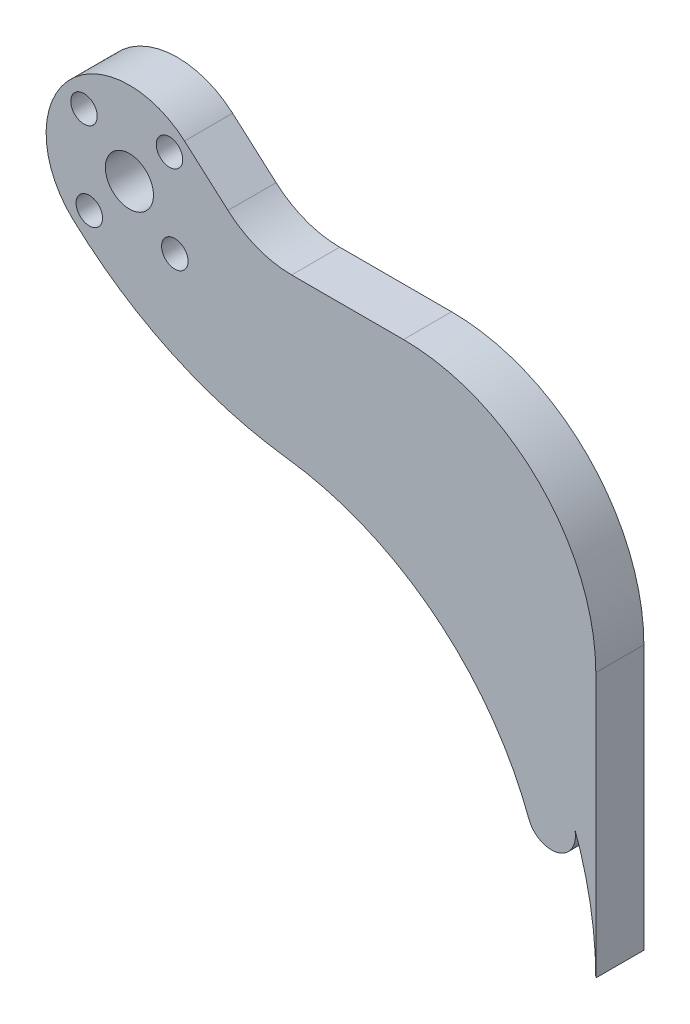
ISO-10303-21;
HEADER;
FILE_DESCRIPTION(('STEP AP214'),'2;1');
FILE_NAME('part.step','',(''),(''),'','','');
FILE_SCHEMA(('AUTOMOTIVE_DESIGN { 1 0 10303 214 1 1 1 1 }'));
ENDSEC;
DATA;
#1=APPLICATION_CONTEXT('core data for automotive mechanical design processes');
#2=APPLICATION_PROTOCOL_DEFINITION('international standard','automotive_design',2000,#1);
#3=PRODUCT_CONTEXT('',#1,'mechanical');
#4=PRODUCT('Part','Part','',(#3));
#5=PRODUCT_RELATED_PRODUCT_CATEGORY('part','',(#4));
#6=PRODUCT_DEFINITION_FORMATION('','',#4);
#7=PRODUCT_DEFINITION_CONTEXT('part definition',#1,'design');
#8=PRODUCT_DEFINITION('design','',#6,#7);
#9=PRODUCT_DEFINITION_SHAPE('','',#8);
#10=(LENGTH_UNIT() NAMED_UNIT(*) SI_UNIT(.MILLI.,.METRE.));
#11=(NAMED_UNIT(*) PLANE_ANGLE_UNIT() SI_UNIT($,.RADIAN.));
#12=(NAMED_UNIT(*) SI_UNIT($,.STERADIAN.) SOLID_ANGLE_UNIT());
#13=UNCERTAINTY_MEASURE_WITH_UNIT(LENGTH_MEASURE(1.E-05),#10,'distance_accuracy_value','');
#14=(GEOMETRIC_REPRESENTATION_CONTEXT(3) GLOBAL_UNCERTAINTY_ASSIGNED_CONTEXT((#13)) GLOBAL_UNIT_ASSIGNED_CONTEXT((#10,
#11,#12)) REPRESENTATION_CONTEXT('',''));
#15=CARTESIAN_POINT('',(0.,0.,0.));
#16=DIRECTION('',(0.,0.,1.));
#17=DIRECTION('',(1.,0.,0.));
#18=AXIS2_PLACEMENT_3D('',#15,#16,#17);
#19=CARTESIAN_POINT('',(11.2309982796719,89.467835436217,6.35));
#20=DIRECTION('',(0.,0.,-1.));
#21=DIRECTION('',(-1.,0.,0.));
#22=AXIS2_PLACEMENT_3D('',#19,#20,#21);
#23=CYLINDRICAL_SURFACE('',#22,50.8);
#24=CARTESIAN_POINT('',(11.2309982796719,89.467835436217,0.));
#25=DIRECTION('',(0.,0.,1.));
#26=DIRECTION('',(1.,0.,0.));
#27=AXIS2_PLACEMENT_3D('',#24,#25,#26);
#28=CIRCLE('',#27,50.8);
#29=CARTESIAN_POINT('',(-23.3666075647334,52.2704474925029,0.));
#30=VERTEX_POINT('',#29);
#31=CARTESIAN_POINT('',(4.90367530520886,39.0634211059539,0.));
#32=VERTEX_POINT('',#31);
#33=EDGE_CURVE('E165',#30,#32,#28,.T.);
#34=ORIENTED_EDGE('',*,*,#33,.T.);
#35=DIRECTION('',(0.,0.,-1.));
#36=VECTOR('',#35,1.);
#37=CARTESIAN_POINT('',(4.90367530520886,39.0634211059539,6.35));
#38=LINE('',#37,#36);
#39=CARTESIAN_POINT('',(4.90367530520886,39.0634211059539,6.35));
#40=VERTEX_POINT('',#39);
#41=EDGE_CURVE('E199',#40,#32,#38,.T.);
#42=ORIENTED_EDGE('',*,*,#41,.F.);
#43=CARTESIAN_POINT('',(11.2309982796719,89.467835436217,6.35));
#44=DIRECTION('',(0.,0.,1.));
#45=DIRECTION('',(1.,0.,0.));
#46=AXIS2_PLACEMENT_3D('',#43,#44,#45);
#47=CIRCLE('',#46,50.8);
#48=CARTESIAN_POINT('',(-23.3666075647334,52.2704474925029,6.35));
#49=VERTEX_POINT('',#48);
#50=EDGE_CURVE('E168',#49,#40,#47,.T.);
#51=ORIENTED_EDGE('',*,*,#50,.F.);
#52=DIRECTION('',(0.,0.,-1.));
#53=VECTOR('',#52,1.);
#54=CARTESIAN_POINT('',(-23.3666075647334,52.2704474925029,6.35));
#55=LINE('',#54,#53);
#56=EDGE_CURVE('E179',#49,#30,#55,.T.);
#57=ORIENTED_EDGE('',*,*,#56,.T.);
#58=EDGE_LOOP('',(#34,#42,#51,#57));
#59=FACE_BOUND('',#58,.T.);
#60=ADVANCED_FACE('F33',(#59),#23,.T.);
#61=CARTESIAN_POINT('',(0.,0.,6.35));
#62=DIRECTION('',(0.,0.,-1.));
#63=DIRECTION('',(-1.,0.,0.));
#64=AXIS2_PLACEMENT_3D('',#61,#62,#63);
#65=CYLINDRICAL_SURFACE('',#64,39.37);
#66=CARTESIAN_POINT('',(0.,0.,0.));
#67=DIRECTION('',(0.,0.,-1.));
#68=DIRECTION('',(1.,0.,0.));
#69=AXIS2_PLACEMENT_3D('',#66,#67,#68);
#70=CIRCLE('',#69,39.37);
#71=CARTESIAN_POINT('',(36.8802784944892,13.778314779715,0.));
#72=VERTEX_POINT('',#71);
#73=EDGE_CURVE('E182',#32,#72,#70,.T.);
#74=ORIENTED_EDGE('',*,*,#73,.T.);
#75=DIRECTION('',(0.,0.,-1.));
#76=VECTOR('',#75,1.);
#77=CARTESIAN_POINT('',(36.8802784944892,13.778314779715,6.35));
#78=LINE('',#77,#76);
#79=CARTESIAN_POINT('',(36.8802784944892,13.778314779715,6.35));
#80=VERTEX_POINT('',#79);
#81=EDGE_CURVE('E196',#80,#72,#78,.T.);
#82=ORIENTED_EDGE('',*,*,#81,.F.);
#83=CARTESIAN_POINT('',(0.,0.,6.35));
#84=DIRECTION('',(0.,0.,-1.));
#85=DIRECTION('',(1.,0.,0.));
#86=AXIS2_PLACEMENT_3D('',#83,#84,#85);
#87=CIRCLE('',#86,39.37);
#88=EDGE_CURVE('E171',#40,#80,#87,.T.);
#89=ORIENTED_EDGE('',*,*,#88,.F.);
#90=ORIENTED_EDGE('',*,*,#41,.T.);
#91=EDGE_LOOP('',(#74,#82,#89,#90));
#92=FACE_BOUND('',#91,.T.);
#93=ADVANCED_FACE('F241',(#92),#65,.F.);
#94=CARTESIAN_POINT('',(39.8544945021093,14.889469197434,6.35));
#95=DIRECTION('',(0.,0.,-1.));
#96=DIRECTION('',(-1.,0.,0.));
#97=AXIS2_PLACEMENT_3D('',#94,#95,#96);
#98=CYLINDRICAL_SURFACE('',#97,3.175);
#99=CARTESIAN_POINT('',(39.8544945021093,14.889469197434,0.));
#100=DIRECTION('',(0.,0.,1.));
#101=DIRECTION('',(1.,0.,0.));
#102=AXIS2_PLACEMENT_3D('',#99,#100,#101);
#103=CIRCLE('',#102,3.175);
#104=CARTESIAN_POINT('',(42.8287105097295,16.0006236151529,0.));
#105=VERTEX_POINT('',#104);
#106=EDGE_CURVE('E184',#72,#105,#103,.T.);
#107=ORIENTED_EDGE('',*,*,#106,.T.);
#108=DIRECTION('',(0.,0.,-1.));
#109=VECTOR('',#108,1.);
#110=CARTESIAN_POINT('',(42.8287105097295,16.0006236151529,6.35));
#111=LINE('',#110,#109);
#112=CARTESIAN_POINT('',(42.8287105097295,16.0006236151529,6.35));
#113=VERTEX_POINT('',#112);
#114=EDGE_CURVE('E194',#113,#105,#111,.T.);
#115=ORIENTED_EDGE('',*,*,#114,.F.);
#116=CARTESIAN_POINT('',(39.8544945021093,14.889469197434,6.35));
#117=DIRECTION('',(0.,0.,1.));
#118=DIRECTION('',(1.,0.,0.));
#119=AXIS2_PLACEMENT_3D('',#116,#117,#118);
#120=CIRCLE('',#119,3.175);
#121=EDGE_CURVE('E128',#80,#113,#120,.T.);
#122=ORIENTED_EDGE('',*,*,#121,.F.);
#123=ORIENTED_EDGE('',*,*,#81,.T.);
#124=EDGE_LOOP('',(#107,#115,#122,#123));
#125=FACE_BOUND('',#124,.T.);
#126=ADVANCED_FACE('F247',(#125),#98,.T.);
#127=CARTESIAN_POINT('',(-8.59545500908298,68.5717099333744,6.35));
#128=DIRECTION('',(-0.661776817356092,-0.749700903034031,0.));
#129=DIRECTION('',(0.749700903034031,-0.661776817356092,0.));
#130=AXIS2_PLACEMENT_3D('',#127,#128,#129);
#131=PLANE('',#130);
#132=DIRECTION('',(-0.749700903034031,0.661776817356092,0.));
#133=VECTOR('',#132,1.);
#134=CARTESIAN_POINT('',(-8.59545500908298,68.5717099333744,6.35));
#135=LINE('',#134,#133);
#136=CARTESIAN_POINT('',(-2.8542176993732,63.5037985314678,6.35));
#137=VERTEX_POINT('',#136);
#138=CARTESIAN_POINT('',(-8.59545500908298,68.5717099333744,6.35));
#139=VERTEX_POINT('',#138);
#140=EDGE_CURVE('E175',#137,#139,#135,.T.);
#141=ORIENTED_EDGE('',*,*,#140,.F.);
#142=DIRECTION('',(0.,0.,-1.));
#143=VECTOR('',#142,1.);
#144=CARTESIAN_POINT('',(-2.8542176993732,63.5037985314678,6.35));
#145=LINE('',#144,#143);
#146=CARTESIAN_POINT('',(-2.8542176993732,63.5037985314678,0.));
#147=VERTEX_POINT('',#146);
#148=EDGE_CURVE('E202',#137,#147,#145,.T.);
#149=ORIENTED_EDGE('',*,*,#148,.T.);
#150=DIRECTION('',(-0.749700903034031,0.661776817356092,0.));
#151=VECTOR('',#150,1.);
#152=CARTESIAN_POINT('',(-8.59545500908298,68.5717099333744,0.));
#153=LINE('',#152,#151);
#154=CARTESIAN_POINT('',(-8.59545500908298,68.5717099333744,0.));
#155=VERTEX_POINT('',#154);
#156=EDGE_CURVE('E186',#147,#155,#153,.T.);
#157=ORIENTED_EDGE('',*,*,#156,.T.);
#158=DIRECTION('',(0.,0.,-1.));
#159=VECTOR('',#158,1.);
#160=CARTESIAN_POINT('',(-8.59545500908298,68.5717099333744,6.35));
#161=LINE('',#160,#159);
#162=EDGE_CURVE('E191',#139,#155,#161,.T.);
#163=ORIENTED_EDGE('',*,*,#162,.F.);
#164=EDGE_LOOP('',(#141,#149,#157,#163));
#165=FACE_BOUND('',#164,.T.);
#166=ADVANCED_FACE('F232',(#165),#131,.F.);
#167=CARTESIAN_POINT('',(-15.875,60.325,6.35));
#168=DIRECTION('',(0.,0.,-1.));
#169=DIRECTION('',(-1.,0.,0.));
#170=AXIS2_PLACEMENT_3D('',#167,#168,#169);
#171=CYLINDRICAL_SURFACE('',#170,11.);
#172=CARTESIAN_POINT('',(-15.875,60.325,0.));
#173=DIRECTION('',(0.,0.,1.));
#174=DIRECTION('',(-1.,0.,0.));
#175=AXIS2_PLACEMENT_3D('',#172,#173,#174);
#176=CIRCLE('',#175,11.);
#177=EDGE_CURVE('E172',#155,#30,#176,.T.);
#178=ORIENTED_EDGE('',*,*,#177,.T.);
#179=ORIENTED_EDGE('',*,*,#56,.F.);
#180=CARTESIAN_POINT('',(-15.875,60.325,6.35));
#181=DIRECTION('',(0.,0.,1.));
#182=DIRECTION('',(-1.,0.,0.));
#183=AXIS2_PLACEMENT_3D('',#180,#181,#182);
#184=CIRCLE('',#183,11.);
#185=EDGE_CURVE('E177',#139,#49,#184,.T.);
#186=ORIENTED_EDGE('',*,*,#185,.F.);
#187=ORIENTED_EDGE('',*,*,#162,.T.);
#188=EDGE_LOOP('',(#178,#179,#186,#187));
#189=FACE_BOUND('',#188,.T.);
#190=ADVANCED_FACE('F256',(#189),#171,.T.);
#191=CARTESIAN_POINT('',(11.2309982796719,89.467835436217,6.35));
#192=DIRECTION('',(0.,0.,1.));
#193=DIRECTION('',(1.,0.,0.));
#194=AXIS2_PLACEMENT_3D('',#191,#192,#193);
#195=PLANE('',#194);
#196=DIRECTION('',(0.,-1.,0.));
#197=VECTOR('',#196,1.);
#198=CARTESIAN_POINT('',(45.72,60.325,6.35));
#199=LINE('',#198,#197);
#200=CARTESIAN_POINT('',(45.72,34.925,6.35));
#201=VERTEX_POINT('',#200);
#202=CARTESIAN_POINT('',(45.72,0.,6.35));
#203=VERTEX_POINT('',#202);
#204=EDGE_CURVE('E106',#201,#203,#199,.T.);
#205=ORIENTED_EDGE('',*,*,#204,.F.);
#206=CARTESIAN_POINT('',(20.32,34.925,6.35));
#207=DIRECTION('',(0.,0.,1.));
#208=DIRECTION('',(1.,0.,0.));
#209=AXIS2_PLACEMENT_3D('',#206,#207,#208);
#210=CIRCLE('',#209,25.4);
#211=CARTESIAN_POINT('',(20.32,60.325,6.35));
#212=VERTEX_POINT('',#211);
#213=EDGE_CURVE('E11',#201,#212,#210,.T.);
#214=ORIENTED_EDGE('',*,*,#213,.T.);
#215=DIRECTION('',(1.,0.,0.));
#216=VECTOR('',#215,1.);
#217=CARTESIAN_POINT('',(0.74691801149341,60.325,6.35));
#218=LINE('',#217,#216);
#219=CARTESIAN_POINT('',(5.55034788104916,60.325,6.35));
#220=VERTEX_POINT('',#219);
#221=EDGE_CURVE('E115',#220,#212,#218,.T.);
#222=ORIENTED_EDGE('',*,*,#221,.F.);
#223=CARTESIAN_POINT('',(5.55034788104917,73.025,6.35));
#224=DIRECTION('',(0.,0.,1.));
#225=DIRECTION('',(1.,0.,0.));
#226=AXIS2_PLACEMENT_3D('',#223,#224,#225);
#227=CIRCLE('',#226,12.7);
#228=EDGE_CURVE('E209',#220,#137,#227,.F.);
#229=ORIENTED_EDGE('',*,*,#228,.T.);
#230=ORIENTED_EDGE('',*,*,#140,.T.);
#231=ORIENTED_EDGE('',*,*,#185,.T.);
#232=ORIENTED_EDGE('',*,*,#50,.T.);
#233=ORIENTED_EDGE('',*,*,#88,.T.);
#234=ORIENTED_EDGE('',*,*,#121,.T.);
#235=CARTESIAN_POINT('',(0.,0.,6.35));
#236=DIRECTION('',(0.,0.,1.));
#237=DIRECTION('',(1.,0.,0.));
#238=AXIS2_PLACEMENT_3D('',#235,#236,#237);
#239=CIRCLE('',#238,45.72);
#240=EDGE_CURVE('E114',#203,#113,#239,.T.);
#241=ORIENTED_EDGE('',*,*,#240,.F.);
#242=EDGE_LOOP('',(#205,#214,#222,#229,#230,#231,#232,#233,#234,#241));
#243=FACE_BOUND('',#242,.T.);
#244=CARTESIAN_POINT('',(-21.8726072242722,65.6192145388485,6.35));
#245=DIRECTION('',(0.,0.,1.));
#246=DIRECTION('',(1.,0.,0.));
#247=AXIS2_PLACEMENT_3D('',#244,#245,#246);
#248=CIRCLE('',#247,1.75000000000001);
#249=CARTESIAN_POINT('',(-20.1226072242722,65.6192145388485,6.35));
#250=VERTEX_POINT('',#249);
#251=EDGE_CURVE('E123',#250,#250,#248,.T.);
#252=ORIENTED_EDGE('',*,*,#251,.F.);
#253=EDGE_LOOP('',(#252));
#254=FACE_BOUND('',#253,.T.);
#255=CARTESIAN_POINT('',(-21.1692145388484,54.3273927757275,6.35));
#256=DIRECTION('',(0.,0.,1.));
#257=DIRECTION('',(1.,0.,0.));
#258=AXIS2_PLACEMENT_3D('',#255,#256,#257);
#259=CIRCLE('',#258,1.75);
#260=CARTESIAN_POINT('',(-19.4192145388484,54.3273927757275,6.35));
#261=VERTEX_POINT('',#260);
#262=EDGE_CURVE('E141',#261,#261,#259,.T.);
#263=ORIENTED_EDGE('',*,*,#262,.F.);
#264=EDGE_LOOP('',(#263));
#265=FACE_BOUND('',#264,.T.);
#266=CARTESIAN_POINT('',(-9.87739277572743,55.0307854611513,6.35));
#267=DIRECTION('',(0.,0.,1.));
#268=DIRECTION('',(1.,0.,0.));
#269=AXIS2_PLACEMENT_3D('',#266,#267,#268);
#270=CIRCLE('',#269,1.75);
#271=CARTESIAN_POINT('',(-8.12739277572743,55.0307854611513,6.35));
#272=VERTEX_POINT('',#271);
#273=EDGE_CURVE('E147',#272,#272,#270,.T.);
#274=ORIENTED_EDGE('',*,*,#273,.F.);
#275=EDGE_LOOP('',(#274));
#276=FACE_BOUND('',#275,.T.);
#277=CARTESIAN_POINT('',(-10.5807854611513,66.3226072242723,6.35));
#278=DIRECTION('',(0.,0.,1.));
#279=DIRECTION('',(1.,0.,0.));
#280=AXIS2_PLACEMENT_3D('',#277,#278,#279);
#281=CIRCLE('',#280,1.75);
#282=CARTESIAN_POINT('',(-8.83078546115125,66.3226072242723,6.35));
#283=VERTEX_POINT('',#282);
#284=EDGE_CURVE('E153',#283,#283,#281,.T.);
#285=ORIENTED_EDGE('',*,*,#284,.F.);
#286=EDGE_LOOP('',(#285));
#287=FACE_BOUND('',#286,.T.);
#288=CARTESIAN_POINT('',(-15.875,60.325,6.35));
#289=DIRECTION('',(0.,0.,1.));
#290=DIRECTION('',(1.,0.,0.));
#291=AXIS2_PLACEMENT_3D('',#288,#289,#290);
#292=CIRCLE('',#291,3.175);
#293=CARTESIAN_POINT('',(-12.7,60.325,6.35));
#294=VERTEX_POINT('',#293);
#295=EDGE_CURVE('E159',#294,#294,#292,.T.);
#296=ORIENTED_EDGE('',*,*,#295,.F.);
#297=EDGE_LOOP('',(#296));
#298=FACE_BOUND('',#297,.T.);
#299=ADVANCED_FACE('F125',(#243,#254,#265,#276,#287,#298),#195,.T.);
#300=CARTESIAN_POINT('',(11.2309982796719,89.467835436217,0.));
#301=DIRECTION('',(0.,0.,1.));
#302=DIRECTION('',(1.,0.,0.));
#303=AXIS2_PLACEMENT_3D('',#300,#301,#302);
#304=PLANE('',#303);
#305=DIRECTION('',(1.,0.,0.));
#306=VECTOR('',#305,1.);
#307=CARTESIAN_POINT('',(0.74691801149341,60.325,0.));
#308=LINE('',#307,#306);
#309=CARTESIAN_POINT('',(5.55034788104916,60.325,0.));
#310=VERTEX_POINT('',#309);
#311=CARTESIAN_POINT('',(20.32,60.325,0.));
#312=VERTEX_POINT('',#311);
#313=EDGE_CURVE('E133',#310,#312,#308,.T.);
#314=ORIENTED_EDGE('',*,*,#313,.T.);
#315=CARTESIAN_POINT('',(20.32,34.925,0.));
#316=DIRECTION('',(0.,0.,1.));
#317=DIRECTION('',(1.,0.,0.));
#318=AXIS2_PLACEMENT_3D('',#315,#316,#317);
#319=CIRCLE('',#318,25.4);
#320=CARTESIAN_POINT('',(45.72,34.925,0.));
#321=VERTEX_POINT('',#320);
#322=EDGE_CURVE('E55',#312,#321,#319,.F.);
#323=ORIENTED_EDGE('',*,*,#322,.T.);
#324=DIRECTION('',(0.,-1.,0.));
#325=VECTOR('',#324,1.);
#326=CARTESIAN_POINT('',(45.72,60.325,0.));
#327=LINE('',#326,#325);
#328=CARTESIAN_POINT('',(45.72,0.,0.));
#329=VERTEX_POINT('',#328);
#330=EDGE_CURVE('E135',#321,#329,#327,.T.);
#331=ORIENTED_EDGE('',*,*,#330,.T.);
#332=CARTESIAN_POINT('',(0.,0.,0.));
#333=DIRECTION('',(0.,0.,1.));
#334=DIRECTION('',(1.,0.,0.));
#335=AXIS2_PLACEMENT_3D('',#332,#333,#334);
#336=CIRCLE('',#335,45.72);
#337=EDGE_CURVE('E122',#329,#105,#336,.T.);
#338=ORIENTED_EDGE('',*,*,#337,.T.);
#339=ORIENTED_EDGE('',*,*,#106,.F.);
#340=ORIENTED_EDGE('',*,*,#73,.F.);
#341=ORIENTED_EDGE('',*,*,#33,.F.);
#342=ORIENTED_EDGE('',*,*,#177,.F.);
#343=ORIENTED_EDGE('',*,*,#156,.F.);
#344=CARTESIAN_POINT('',(5.55034788104917,73.025,0.));
#345=DIRECTION('',(0.,0.,1.));
#346=DIRECTION('',(1.,0.,0.));
#347=AXIS2_PLACEMENT_3D('',#344,#345,#346);
#348=CIRCLE('',#347,12.7);
#349=EDGE_CURVE('E207',#147,#310,#348,.T.);
#350=ORIENTED_EDGE('',*,*,#349,.T.);
#351=EDGE_LOOP('',(#314,#323,#331,#338,#339,#340,#341,#342,#343,#350));
#352=FACE_BOUND('',#351,.T.);
#353=CARTESIAN_POINT('',(-21.8726072242722,65.6192145388485,0.));
#354=DIRECTION('',(0.,0.,1.));
#355=DIRECTION('',(1.,0.,0.));
#356=AXIS2_PLACEMENT_3D('',#353,#354,#355);
#357=CIRCLE('',#356,1.75000000000001);
#358=CARTESIAN_POINT('',(-20.1226072242722,65.6192145388485,0.));
#359=VERTEX_POINT('',#358);
#360=EDGE_CURVE('E138',#359,#359,#357,.T.);
#361=ORIENTED_EDGE('',*,*,#360,.T.);
#362=EDGE_LOOP('',(#361));
#363=FACE_BOUND('',#362,.T.);
#364=CARTESIAN_POINT('',(-21.1692145388484,54.3273927757275,0.));
#365=DIRECTION('',(0.,0.,1.));
#366=DIRECTION('',(1.,0.,0.));
#367=AXIS2_PLACEMENT_3D('',#364,#365,#366);
#368=CIRCLE('',#367,1.75);
#369=CARTESIAN_POINT('',(-19.4192145388484,54.3273927757275,0.));
#370=VERTEX_POINT('',#369);
#371=EDGE_CURVE('E144',#370,#370,#368,.T.);
#372=ORIENTED_EDGE('',*,*,#371,.T.);
#373=EDGE_LOOP('',(#372));
#374=FACE_BOUND('',#373,.T.);
#375=CARTESIAN_POINT('',(-9.87739277572743,55.0307854611513,0.));
#376=DIRECTION('',(0.,0.,1.));
#377=DIRECTION('',(1.,0.,0.));
#378=AXIS2_PLACEMENT_3D('',#375,#376,#377);
#379=CIRCLE('',#378,1.75);
#380=CARTESIAN_POINT('',(-8.12739277572743,55.0307854611513,0.));
#381=VERTEX_POINT('',#380);
#382=EDGE_CURVE('E150',#381,#381,#379,.T.);
#383=ORIENTED_EDGE('',*,*,#382,.T.);
#384=EDGE_LOOP('',(#383));
#385=FACE_BOUND('',#384,.T.);
#386=CARTESIAN_POINT('',(-10.5807854611513,66.3226072242723,0.));
#387=DIRECTION('',(0.,0.,1.));
#388=DIRECTION('',(1.,0.,0.));
#389=AXIS2_PLACEMENT_3D('',#386,#387,#388);
#390=CIRCLE('',#389,1.75);
#391=CARTESIAN_POINT('',(-8.83078546115125,66.3226072242723,0.));
#392=VERTEX_POINT('',#391);
#393=EDGE_CURVE('E156',#392,#392,#390,.T.);
#394=ORIENTED_EDGE('',*,*,#393,.T.);
#395=EDGE_LOOP('',(#394));
#396=FACE_BOUND('',#395,.T.);
#397=CARTESIAN_POINT('',(-15.875,60.325,0.));
#398=DIRECTION('',(0.,0.,1.));
#399=DIRECTION('',(1.,0.,0.));
#400=AXIS2_PLACEMENT_3D('',#397,#398,#399);
#401=CIRCLE('',#400,3.175);
#402=CARTESIAN_POINT('',(-12.7,60.325,0.));
#403=VERTEX_POINT('',#402);
#404=EDGE_CURVE('E162',#403,#403,#401,.T.);
#405=ORIENTED_EDGE('',*,*,#404,.T.);
#406=EDGE_LOOP('',(#405));
#407=FACE_BOUND('',#406,.T.);
#408=ADVANCED_FACE('F222',(#352,#363,#374,#385,#396,#407),#304,.F.);
#409=CARTESIAN_POINT('',(-15.875,60.325,0.));
#410=DIRECTION('',(0.,0.,1.));
#411=DIRECTION('',(1.,0.,0.));
#412=AXIS2_PLACEMENT_3D('',#409,#410,#411);
#413=CYLINDRICAL_SURFACE('',#412,3.175);
#414=ORIENTED_EDGE('',*,*,#404,.F.);
#415=EDGE_LOOP('',(#414));
#416=FACE_BOUND('',#415,.T.);
#417=ORIENTED_EDGE('',*,*,#295,.T.);
#418=EDGE_LOOP('',(#417));
#419=FACE_BOUND('',#418,.T.);
#420=ADVANCED_FACE('F262',(#416,#419),#413,.F.);
#421=CARTESIAN_POINT('',(-10.5807854611513,66.3226072242723,0.));
#422=DIRECTION('',(0.,0.,1.));
#423=DIRECTION('',(1.,0.,0.));
#424=AXIS2_PLACEMENT_3D('',#421,#422,#423);
#425=CYLINDRICAL_SURFACE('',#424,1.75);
#426=ORIENTED_EDGE('',*,*,#393,.F.);
#427=EDGE_LOOP('',(#426));
#428=FACE_BOUND('',#427,.T.);
#429=ORIENTED_EDGE('',*,*,#284,.T.);
#430=EDGE_LOOP('',(#429));
#431=FACE_BOUND('',#430,.T.);
#432=ADVANCED_FACE('F267',(#428,#431),#425,.F.);
#433=CARTESIAN_POINT('',(-9.87739277572743,55.0307854611513,0.));
#434=DIRECTION('',(0.,0.,1.));
#435=DIRECTION('',(1.,0.,0.));
#436=AXIS2_PLACEMENT_3D('',#433,#434,#435);
#437=CYLINDRICAL_SURFACE('',#436,1.75);
#438=ORIENTED_EDGE('',*,*,#382,.F.);
#439=EDGE_LOOP('',(#438));
#440=FACE_BOUND('',#439,.T.);
#441=ORIENTED_EDGE('',*,*,#273,.T.);
#442=EDGE_LOOP('',(#441));
#443=FACE_BOUND('',#442,.T.);
#444=ADVANCED_FACE('F271',(#440,#443),#437,.F.);
#445=CARTESIAN_POINT('',(-21.1692145388484,54.3273927757275,0.));
#446=DIRECTION('',(0.,0.,1.));
#447=DIRECTION('',(1.,0.,0.));
#448=AXIS2_PLACEMENT_3D('',#445,#446,#447);
#449=CYLINDRICAL_SURFACE('',#448,1.75);
#450=ORIENTED_EDGE('',*,*,#371,.F.);
#451=EDGE_LOOP('',(#450));
#452=FACE_BOUND('',#451,.T.);
#453=ORIENTED_EDGE('',*,*,#262,.T.);
#454=EDGE_LOOP('',(#453));
#455=FACE_BOUND('',#454,.T.);
#456=ADVANCED_FACE('F275',(#452,#455),#449,.F.);
#457=CARTESIAN_POINT('',(-21.8726072242722,65.6192145388485,0.));
#458=DIRECTION('',(0.,0.,1.));
#459=DIRECTION('',(1.,0.,0.));
#460=AXIS2_PLACEMENT_3D('',#457,#458,#459);
#461=CYLINDRICAL_SURFACE('',#460,1.75000000000001);
#462=ORIENTED_EDGE('',*,*,#360,.F.);
#463=EDGE_LOOP('',(#462));
#464=FACE_BOUND('',#463,.T.);
#465=ORIENTED_EDGE('',*,*,#251,.T.);
#466=EDGE_LOOP('',(#465));
#467=FACE_BOUND('',#466,.T.);
#468=ADVANCED_FACE('F279',(#464,#467),#461,.F.);
#469=CARTESIAN_POINT('',(0.,0.,6.35));
#470=DIRECTION('',(0.,0.,-1.));
#471=DIRECTION('',(-1.,0.,0.));
#472=AXIS2_PLACEMENT_3D('',#469,#470,#471);
#473=CYLINDRICAL_SURFACE('',#472,45.72);
#474=ORIENTED_EDGE('',*,*,#240,.T.);
#475=ORIENTED_EDGE('',*,*,#114,.T.);
#476=ORIENTED_EDGE('',*,*,#337,.F.);
#477=DIRECTION('',(0.,0.,-1.));
#478=VECTOR('',#477,1.);
#479=CARTESIAN_POINT('',(45.72,0.,6.35));
#480=LINE('',#479,#478);
#481=EDGE_CURVE('E109',#203,#329,#480,.T.);
#482=ORIENTED_EDGE('',*,*,#481,.F.);
#483=EDGE_LOOP('',(#474,#475,#476,#482));
#484=FACE_BOUND('',#483,.T.);
#485=ADVANCED_FACE('F119',(#484),#473,.F.);
#486=CARTESIAN_POINT('',(45.72,60.325,6.35));
#487=DIRECTION('',(1.,0.,0.));
#488=DIRECTION('',(0.,1.,0.));
#489=AXIS2_PLACEMENT_3D('',#486,#487,#488);
#490=PLANE('',#489);
#491=ORIENTED_EDGE('',*,*,#330,.F.);
#492=DIRECTION('',(0.,0.,-1.));
#493=VECTOR('',#492,1.);
#494=CARTESIAN_POINT('',(45.72,34.925,6.35));
#495=LINE('',#494,#493);
#496=EDGE_CURVE('E41',#321,#201,#495,.F.);
#497=ORIENTED_EDGE('',*,*,#496,.T.);
#498=ORIENTED_EDGE('',*,*,#204,.T.);
#499=ORIENTED_EDGE('',*,*,#481,.T.);
#500=EDGE_LOOP('',(#491,#497,#498,#499));
#501=FACE_BOUND('',#500,.T.);
#502=ADVANCED_FACE('F108',(#501),#490,.T.);
#503=CARTESIAN_POINT('',(0.74691801149341,60.325,6.35));
#504=DIRECTION('',(0.,1.,0.));
#505=DIRECTION('',(-1.,0.,0.));
#506=AXIS2_PLACEMENT_3D('',#503,#504,#505);
#507=PLANE('',#506);
#508=ORIENTED_EDGE('',*,*,#221,.T.);
#509=DIRECTION('',(0.,0.,-1.));
#510=VECTOR('',#509,1.);
#511=CARTESIAN_POINT('',(20.32,60.325,6.35));
#512=LINE('',#511,#510);
#513=EDGE_CURVE('E211',#212,#312,#512,.T.);
#514=ORIENTED_EDGE('',*,*,#513,.T.);
#515=ORIENTED_EDGE('',*,*,#313,.F.);
#516=DIRECTION('',(0.,0.,-1.));
#517=VECTOR('',#516,1.);
#518=CARTESIAN_POINT('',(5.55034788104916,60.325,6.35));
#519=LINE('',#518,#517);
#520=EDGE_CURVE('E205',#310,#220,#519,.F.);
#521=ORIENTED_EDGE('',*,*,#520,.T.);
#522=EDGE_LOOP('',(#508,#514,#515,#521));
#523=FACE_BOUND('',#522,.T.);
#524=ADVANCED_FACE('F218',(#523),#507,.T.);
#525=CARTESIAN_POINT('',(5.55034788104917,73.025,6.35));
#526=DIRECTION('',(0.,0.,-1.));
#527=DIRECTION('',(-1.,0.,0.));
#528=AXIS2_PLACEMENT_3D('',#525,#526,#527);
#529=CYLINDRICAL_SURFACE('',#528,12.7);
#530=ORIENTED_EDGE('',*,*,#228,.F.);
#531=ORIENTED_EDGE('',*,*,#520,.F.);
#532=ORIENTED_EDGE('',*,*,#349,.F.);
#533=ORIENTED_EDGE('',*,*,#148,.F.);
#534=EDGE_LOOP('',(#530,#531,#532,#533));
#535=FACE_BOUND('',#534,.T.);
#536=ADVANCED_FACE('F229',(#535),#529,.F.);
#537=CARTESIAN_POINT('',(20.32,34.925,6.35));
#538=DIRECTION('',(0.,0.,-1.));
#539=DIRECTION('',(-1.,0.,0.));
#540=AXIS2_PLACEMENT_3D('',#537,#538,#539);
#541=CYLINDRICAL_SURFACE('',#540,25.4);
#542=ORIENTED_EDGE('',*,*,#213,.F.);
#543=ORIENTED_EDGE('',*,*,#496,.F.);
#544=ORIENTED_EDGE('',*,*,#322,.F.);
#545=ORIENTED_EDGE('',*,*,#513,.F.);
#546=EDGE_LOOP('',(#542,#543,#544,#545));
#547=FACE_BOUND('',#546,.T.);
#548=ADVANCED_FACE('F35',(#547),#541,.T.);
#549=CLOSED_SHELL('',(#60,#93,#126,#166,#190,#299,#408,#420,#432,#444,#456,#468,#485,#502,#524,
#536,#548));
#550=MANIFOLD_SOLID_BREP('B2',#549);
#551=ADVANCED_BREP_SHAPE_REPRESENTATION('',(#18,#550),#14);
#552=SHAPE_DEFINITION_REPRESENTATION(#9,#551);
ENDSEC;
END-ISO-10303-21;
